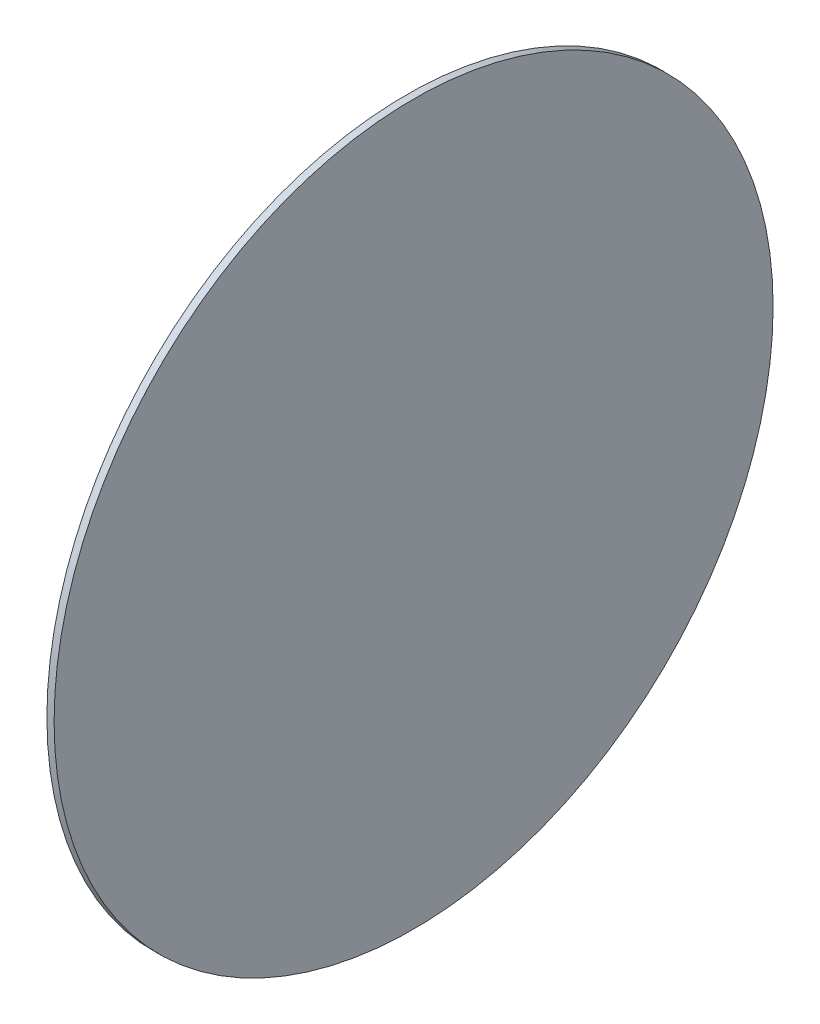
ISO-10303-21;
HEADER;
FILE_DESCRIPTION(('STEP AP214'),'2;1');
FILE_NAME('part.step','',(''),(''),'','','');
FILE_SCHEMA(('AUTOMOTIVE_DESIGN { 1 0 10303 214 1 1 1 1 }'));
ENDSEC;
DATA;
#1=APPLICATION_CONTEXT('core data for automotive mechanical design processes');
#2=APPLICATION_PROTOCOL_DEFINITION('international standard','automotive_design',2000,#1);
#3=PRODUCT_CONTEXT('',#1,'mechanical');
#4=PRODUCT('Part','Part','',(#3));
#5=PRODUCT_RELATED_PRODUCT_CATEGORY('part','',(#4));
#6=PRODUCT_DEFINITION_FORMATION('','',#4);
#7=PRODUCT_DEFINITION_CONTEXT('part definition',#1,'design');
#8=PRODUCT_DEFINITION('design','',#6,#7);
#9=PRODUCT_DEFINITION_SHAPE('','',#8);
#10=(LENGTH_UNIT() NAMED_UNIT(*) SI_UNIT(.MILLI.,.METRE.));
#11=(NAMED_UNIT(*) PLANE_ANGLE_UNIT() SI_UNIT($,.RADIAN.));
#12=(NAMED_UNIT(*) SI_UNIT($,.STERADIAN.) SOLID_ANGLE_UNIT());
#13=UNCERTAINTY_MEASURE_WITH_UNIT(LENGTH_MEASURE(1.E-05),#10,'distance_accuracy_value','');
#14=(GEOMETRIC_REPRESENTATION_CONTEXT(3) GLOBAL_UNCERTAINTY_ASSIGNED_CONTEXT((#13)) GLOBAL_UNIT_ASSIGNED_CONTEXT((#10,
#11,#12)) REPRESENTATION_CONTEXT('',''));
#15=CARTESIAN_POINT('',(0.,0.,0.));
#16=DIRECTION('',(0.,0.,1.));
#17=DIRECTION('',(1.,0.,0.));
#18=AXIS2_PLACEMENT_3D('',#15,#16,#17);
#19=CARTESIAN_POINT('',(3.,0.,0.));
#20=DIRECTION('',(-1.,0.,0.));
#21=DIRECTION('',(0.,0.,1.));
#22=AXIS2_PLACEMENT_3D('',#19,#20,#21);
#23=CYLINDRICAL_SURFACE('',#22,150.);
#24=CARTESIAN_POINT('',(3.,0.,0.));
#25=DIRECTION('',(1.,0.,0.));
#26=DIRECTION('',(0.,0.,-1.));
#27=AXIS2_PLACEMENT_3D('',#24,#25,#26);
#28=CIRCLE('',#27,150.);
#29=CARTESIAN_POINT('',(3.,0.,-150.));
#30=VERTEX_POINT('',#29);
#31=EDGE_CURVE('E10',#30,#30,#28,.T.);
#32=ORIENTED_EDGE('',*,*,#31,.F.);
#33=EDGE_LOOP('',(#32));
#34=FACE_BOUND('',#33,.T.);
#35=CARTESIAN_POINT('',(0.,0.,0.));
#36=DIRECTION('',(1.,0.,0.));
#37=DIRECTION('',(0.,0.,-1.));
#38=AXIS2_PLACEMENT_3D('',#35,#36,#37);
#39=CIRCLE('',#38,150.);
#40=CARTESIAN_POINT('',(0.,0.,-150.));
#41=VERTEX_POINT('',#40);
#42=EDGE_CURVE('E37',#41,#41,#39,.T.);
#43=ORIENTED_EDGE('',*,*,#42,.T.);
#44=EDGE_LOOP('',(#43));
#45=FACE_BOUND('',#44,.T.);
#46=ADVANCED_FACE('F34',(#34,#45),#23,.T.);
#47=CARTESIAN_POINT('',(3.,0.,0.));
#48=DIRECTION('',(1.,0.,0.));
#49=DIRECTION('',(0.,0.,-1.));
#50=AXIS2_PLACEMENT_3D('',#47,#48,#49);
#51=PLANE('',#50);
#52=ORIENTED_EDGE('',*,*,#31,.T.);
#53=EDGE_LOOP('',(#52));
#54=FACE_BOUND('',#53,.T.);
#55=ADVANCED_FACE('F49',(#54),#51,.T.);
#56=CARTESIAN_POINT('',(0.,0.,0.));
#57=DIRECTION('',(1.,0.,0.));
#58=DIRECTION('',(0.,0.,-1.));
#59=AXIS2_PLACEMENT_3D('',#56,#57,#58);
#60=PLANE('',#59);
#61=ORIENTED_EDGE('',*,*,#42,.F.);
#62=EDGE_LOOP('',(#61));
#63=FACE_BOUND('',#62,.T.);
#64=ADVANCED_FACE('F47',(#63),#60,.F.);
#65=CLOSED_SHELL('',(#46,#55,#64));
#66=MANIFOLD_SOLID_BREP('B2',#65);
#67=ADVANCED_BREP_SHAPE_REPRESENTATION('',(#18,#66),#14);
#68=SHAPE_DEFINITION_REPRESENTATION(#9,#67);
ENDSEC;
END-ISO-10303-21;
